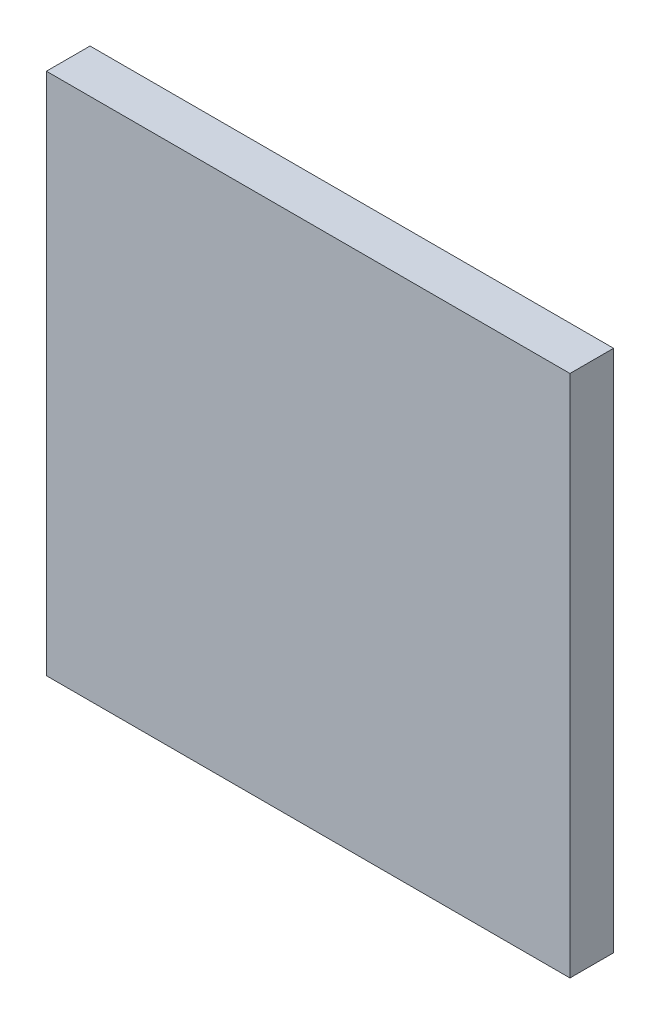
ISO-10303-21;
HEADER;
FILE_DESCRIPTION(('STEP AP214'),'2;1');
FILE_NAME('part.step','',(''),(''),'','','');
FILE_SCHEMA(('AUTOMOTIVE_DESIGN { 1 0 10303 214 1 1 1 1 }'));
ENDSEC;
DATA;
#1=APPLICATION_CONTEXT('core data for automotive mechanical design processes');
#2=APPLICATION_PROTOCOL_DEFINITION('international standard','automotive_design',2000,#1);
#3=PRODUCT_CONTEXT('',#1,'mechanical');
#4=PRODUCT('Part','Part','',(#3));
#5=PRODUCT_RELATED_PRODUCT_CATEGORY('part','',(#4));
#6=PRODUCT_DEFINITION_FORMATION('','',#4);
#7=PRODUCT_DEFINITION_CONTEXT('part definition',#1,'design');
#8=PRODUCT_DEFINITION('design','',#6,#7);
#9=PRODUCT_DEFINITION_SHAPE('','',#8);
#10=(LENGTH_UNIT() NAMED_UNIT(*) SI_UNIT(.MILLI.,.METRE.));
#11=(NAMED_UNIT(*) PLANE_ANGLE_UNIT() SI_UNIT($,.RADIAN.));
#12=(NAMED_UNIT(*) SI_UNIT($,.STERADIAN.) SOLID_ANGLE_UNIT());
#13=UNCERTAINTY_MEASURE_WITH_UNIT(LENGTH_MEASURE(1.E-05),#10,'distance_accuracy_value','');
#14=(GEOMETRIC_REPRESENTATION_CONTEXT(3) GLOBAL_UNCERTAINTY_ASSIGNED_CONTEXT((#13)) GLOBAL_UNIT_ASSIGNED_CONTEXT((#10,
#11,#12)) REPRESENTATION_CONTEXT('',''));
#15=CARTESIAN_POINT('',(0.,0.,0.));
#16=DIRECTION('',(0.,0.,1.));
#17=DIRECTION('',(1.,0.,0.));
#18=AXIS2_PLACEMENT_3D('',#15,#16,#17);
#19=CARTESIAN_POINT('',(-152.4,152.4,-25.4));
#20=DIRECTION('',(-1.,0.,0.));
#21=DIRECTION('',(0.,-1.,0.));
#22=AXIS2_PLACEMENT_3D('',#19,#20,#21);
#23=PLANE('',#22);
#24=DIRECTION('',(0.,-1.,0.));
#25=VECTOR('',#24,1.);
#26=CARTESIAN_POINT('',(-152.4,152.4,0.));
#27=LINE('',#26,#25);
#28=CARTESIAN_POINT('',(-152.4,152.4,0.));
#29=VERTEX_POINT('',#28);
#30=CARTESIAN_POINT('',(-152.4,-152.4,0.));
#31=VERTEX_POINT('',#30);
#32=EDGE_CURVE('E71',#29,#31,#27,.T.);
#33=ORIENTED_EDGE('',*,*,#32,.F.);
#34=DIRECTION('',(0.,0.,1.));
#35=VECTOR('',#34,1.);
#36=CARTESIAN_POINT('',(-152.4,152.4,-25.4));
#37=LINE('',#36,#35);
#38=CARTESIAN_POINT('',(-152.4,152.4,-25.4));
#39=VERTEX_POINT('',#38);
#40=EDGE_CURVE('E11',#39,#29,#37,.T.);
#41=ORIENTED_EDGE('',*,*,#40,.F.);
#42=DIRECTION('',(0.,-1.,0.));
#43=VECTOR('',#42,1.);
#44=CARTESIAN_POINT('',(-152.4,152.4,-25.4));
#45=LINE('',#44,#43);
#46=CARTESIAN_POINT('',(-152.4,-152.4,-25.4));
#47=VERTEX_POINT('',#46);
#48=EDGE_CURVE('E73',#39,#47,#45,.T.);
#49=ORIENTED_EDGE('',*,*,#48,.T.);
#50=DIRECTION('',(0.,0.,1.));
#51=VECTOR('',#50,1.);
#52=CARTESIAN_POINT('',(-152.4,-152.4,-25.4));
#53=LINE('',#52,#51);
#54=EDGE_CURVE('E34',#47,#31,#53,.T.);
#55=ORIENTED_EDGE('',*,*,#54,.T.);
#56=EDGE_LOOP('',(#33,#41,#49,#55));
#57=FACE_BOUND('',#56,.T.);
#58=ADVANCED_FACE('F31',(#57),#23,.T.);
#59=CARTESIAN_POINT('',(-152.4,152.4,-25.4));
#60=DIRECTION('',(0.,1.,0.));
#61=DIRECTION('',(-1.,0.,0.));
#62=AXIS2_PLACEMENT_3D('',#59,#60,#61);
#63=PLANE('',#62);
#64=DIRECTION('',(-1.,0.,0.));
#65=VECTOR('',#64,1.);
#66=CARTESIAN_POINT('',(-152.4,152.4,0.));
#67=LINE('',#66,#65);
#68=CARTESIAN_POINT('',(152.4,152.4,0.));
#69=VERTEX_POINT('',#68);
#70=EDGE_CURVE('E88',#69,#29,#67,.T.);
#71=ORIENTED_EDGE('',*,*,#70,.F.);
#72=DIRECTION('',(0.,0.,1.));
#73=VECTOR('',#72,1.);
#74=CARTESIAN_POINT('',(152.4,152.4,-25.4));
#75=LINE('',#74,#73);
#76=CARTESIAN_POINT('',(152.4,152.4,-25.4));
#77=VERTEX_POINT('',#76);
#78=EDGE_CURVE('E39',#77,#69,#75,.T.);
#79=ORIENTED_EDGE('',*,*,#78,.F.);
#80=DIRECTION('',(-1.,0.,0.));
#81=VECTOR('',#80,1.);
#82=CARTESIAN_POINT('',(-152.4,152.4,-25.4));
#83=LINE('',#82,#81);
#84=EDGE_CURVE('E78',#77,#39,#83,.T.);
#85=ORIENTED_EDGE('',*,*,#84,.T.);
#86=ORIENTED_EDGE('',*,*,#40,.T.);
#87=EDGE_LOOP('',(#71,#79,#85,#86));
#88=FACE_BOUND('',#87,.T.);
#89=ADVANCED_FACE('F103',(#88),#63,.T.);
#90=CARTESIAN_POINT('',(152.4,152.4,-25.4));
#91=DIRECTION('',(1.,0.,0.));
#92=DIRECTION('',(0.,1.,0.));
#93=AXIS2_PLACEMENT_3D('',#90,#91,#92);
#94=PLANE('',#93);
#95=DIRECTION('',(0.,1.,0.));
#96=VECTOR('',#95,1.);
#97=CARTESIAN_POINT('',(152.4,152.4,0.));
#98=LINE('',#97,#96);
#99=CARTESIAN_POINT('',(152.4,-152.4,0.));
#100=VERTEX_POINT('',#99);
#101=EDGE_CURVE('E85',#100,#69,#98,.T.);
#102=ORIENTED_EDGE('',*,*,#101,.F.);
#103=DIRECTION('',(0.,0.,1.));
#104=VECTOR('',#103,1.);
#105=CARTESIAN_POINT('',(152.4,-152.4,-25.4));
#106=LINE('',#105,#104);
#107=CARTESIAN_POINT('',(152.4,-152.4,-25.4));
#108=VERTEX_POINT('',#107);
#109=EDGE_CURVE('E77',#108,#100,#106,.T.);
#110=ORIENTED_EDGE('',*,*,#109,.F.);
#111=DIRECTION('',(0.,1.,0.));
#112=VECTOR('',#111,1.);
#113=CARTESIAN_POINT('',(152.4,152.4,-25.4));
#114=LINE('',#113,#112);
#115=EDGE_CURVE('E96',#108,#77,#114,.T.);
#116=ORIENTED_EDGE('',*,*,#115,.T.);
#117=ORIENTED_EDGE('',*,*,#78,.T.);
#118=EDGE_LOOP('',(#102,#110,#116,#117));
#119=FACE_BOUND('',#118,.T.);
#120=ADVANCED_FACE('F100',(#119),#94,.T.);
#121=CARTESIAN_POINT('',(-152.4,-152.4,-25.4));
#122=DIRECTION('',(0.,-1.,0.));
#123=DIRECTION('',(1.,0.,0.));
#124=AXIS2_PLACEMENT_3D('',#121,#122,#123);
#125=PLANE('',#124);
#126=DIRECTION('',(1.,0.,0.));
#127=VECTOR('',#126,1.);
#128=CARTESIAN_POINT('',(-152.4,-152.4,0.));
#129=LINE('',#128,#127);
#130=EDGE_CURVE('E80',#31,#100,#129,.T.);
#131=ORIENTED_EDGE('',*,*,#130,.F.);
#132=ORIENTED_EDGE('',*,*,#54,.F.);
#133=DIRECTION('',(1.,0.,0.));
#134=VECTOR('',#133,1.);
#135=CARTESIAN_POINT('',(-152.4,-152.4,-25.4));
#136=LINE('',#135,#134);
#137=EDGE_CURVE('E94',#47,#108,#136,.T.);
#138=ORIENTED_EDGE('',*,*,#137,.T.);
#139=ORIENTED_EDGE('',*,*,#109,.T.);
#140=EDGE_LOOP('',(#131,#132,#138,#139));
#141=FACE_BOUND('',#140,.T.);
#142=ADVANCED_FACE('F81',(#141),#125,.T.);
#143=CARTESIAN_POINT('',(-152.4,-152.4,-25.4));
#144=DIRECTION('',(0.,0.,1.));
#145=DIRECTION('',(1.,0.,0.));
#146=AXIS2_PLACEMENT_3D('',#143,#144,#145);
#147=PLANE('',#146);
#148=ORIENTED_EDGE('',*,*,#48,.F.);
#149=ORIENTED_EDGE('',*,*,#84,.F.);
#150=ORIENTED_EDGE('',*,*,#115,.F.);
#151=ORIENTED_EDGE('',*,*,#137,.F.);
#152=EDGE_LOOP('',(#148,#149,#150,#151));
#153=FACE_BOUND('',#152,.T.);
#154=ADVANCED_FACE('F105',(#153),#147,.F.);
#155=CARTESIAN_POINT('',(-152.4,-152.4,0.));
#156=DIRECTION('',(0.,0.,1.));
#157=DIRECTION('',(1.,0.,0.));
#158=AXIS2_PLACEMENT_3D('',#155,#156,#157);
#159=PLANE('',#158);
#160=ORIENTED_EDGE('',*,*,#32,.T.);
#161=ORIENTED_EDGE('',*,*,#130,.T.);
#162=ORIENTED_EDGE('',*,*,#101,.T.);
#163=ORIENTED_EDGE('',*,*,#70,.T.);
#164=EDGE_LOOP('',(#160,#161,#162,#163));
#165=FACE_BOUND('',#164,.T.);
#166=ADVANCED_FACE('F87',(#165),#159,.T.);
#167=CLOSED_SHELL('',(#58,#89,#120,#142,#154,#166));
#168=MANIFOLD_SOLID_BREP('B2',#167);
#169=ADVANCED_BREP_SHAPE_REPRESENTATION('',(#18,#168),#14);
#170=SHAPE_DEFINITION_REPRESENTATION(#9,#169);
ENDSEC;
END-ISO-10303-21;
